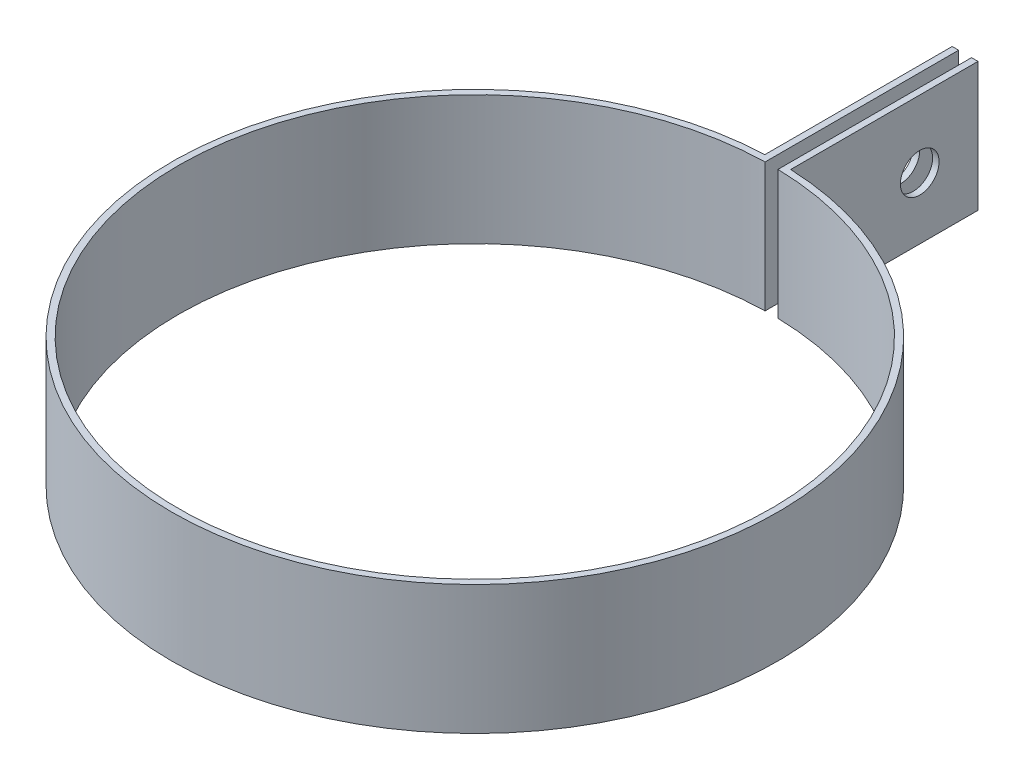
ISO-10303-21;
HEADER;
FILE_DESCRIPTION(('STEP AP214'),'2;1');
FILE_NAME('part.step','',(''),(''),'','','');
FILE_SCHEMA(('AUTOMOTIVE_DESIGN { 1 0 10303 214 1 1 1 1 }'));
ENDSEC;
DATA;
#1=APPLICATION_CONTEXT('core data for automotive mechanical design processes');
#2=APPLICATION_PROTOCOL_DEFINITION('international standard','automotive_design',2000,#1);
#3=PRODUCT_CONTEXT('',#1,'mechanical');
#4=PRODUCT('Part','Part','',(#3));
#5=PRODUCT_RELATED_PRODUCT_CATEGORY('part','',(#4));
#6=PRODUCT_DEFINITION_FORMATION('','',#4);
#7=PRODUCT_DEFINITION_CONTEXT('part definition',#1,'design');
#8=PRODUCT_DEFINITION('design','',#6,#7);
#9=PRODUCT_DEFINITION_SHAPE('','',#8);
#10=(LENGTH_UNIT() NAMED_UNIT(*) SI_UNIT(.MILLI.,.METRE.));
#11=(NAMED_UNIT(*) PLANE_ANGLE_UNIT() SI_UNIT($,.RADIAN.));
#12=(NAMED_UNIT(*) SI_UNIT($,.STERADIAN.) SOLID_ANGLE_UNIT());
#13=UNCERTAINTY_MEASURE_WITH_UNIT(LENGTH_MEASURE(1.E-05),#10,'distance_accuracy_value','');
#14=(GEOMETRIC_REPRESENTATION_CONTEXT(3) GLOBAL_UNCERTAINTY_ASSIGNED_CONTEXT((#13)) GLOBAL_UNIT_ASSIGNED_CONTEXT((#10,
#11,#12)) REPRESENTATION_CONTEXT('',''));
#15=CARTESIAN_POINT('',(0.,0.,0.));
#16=DIRECTION('',(0.,0.,1.));
#17=DIRECTION('',(1.,0.,0.));
#18=AXIS2_PLACEMENT_3D('',#15,#16,#17);
#19=CARTESIAN_POINT('',(-1.,10.,-37.9945645751338));
#20=DIRECTION('',(0.,0.,1.));
#21=DIRECTION('',(1.,0.,0.));
#22=AXIS2_PLACEMENT_3D('',#19,#20,#21);
#23=PLANE('',#22);
#24=DIRECTION('',(-1.,0.,0.));
#25=VECTOR('',#24,1.);
#26=CARTESIAN_POINT('',(-1.,0.,-37.9945645751338));
#27=LINE('',#26,#25);
#28=CARTESIAN_POINT('',(-0.500000000000005,0.,-37.9945645751338));
#29=VERTEX_POINT('',#28);
#30=CARTESIAN_POINT('',(-1.,0.,-37.9945645751338));
#31=VERTEX_POINT('',#30);
#32=EDGE_CURVE('E129',#29,#31,#27,.T.);
#33=ORIENTED_EDGE('',*,*,#32,.T.);
#34=DIRECTION('',(0.,-1.,0.));
#35=VECTOR('',#34,1.);
#36=CARTESIAN_POINT('',(-1.,10.,-37.9945645751338));
#37=LINE('',#36,#35);
#38=CARTESIAN_POINT('',(-1.,10.,-37.9945645751338));
#39=VERTEX_POINT('',#38);
#40=EDGE_CURVE('E11',#39,#31,#37,.T.);
#41=ORIENTED_EDGE('',*,*,#40,.F.);
#42=DIRECTION('',(-1.,0.,0.));
#43=VECTOR('',#42,1.);
#44=CARTESIAN_POINT('',(-1.,10.,-37.9945645751338));
#45=LINE('',#44,#43);
#46=CARTESIAN_POINT('',(-0.500000000000005,10.,-37.9945645751338));
#47=VERTEX_POINT('',#46);
#48=EDGE_CURVE('E144',#47,#39,#45,.T.);
#49=ORIENTED_EDGE('',*,*,#48,.F.);
#50=DIRECTION('',(0.,-1.,0.));
#51=VECTOR('',#50,1.);
#52=CARTESIAN_POINT('',(-0.500000000000005,10.,-37.9945645751338));
#53=LINE('',#52,#51);
#54=EDGE_CURVE('E125',#47,#29,#53,.T.);
#55=ORIENTED_EDGE('',*,*,#54,.T.);
#56=EDGE_LOOP('',(#33,#41,#49,#55));
#57=FACE_BOUND('',#56,.T.);
#58=ADVANCED_FACE('F32',(#57),#23,.F.);
#59=CARTESIAN_POINT('',(-1.,10.,-37.9945645751338));
#60=DIRECTION('',(1.,0.,0.));
#61=DIRECTION('',(0.,0.,-1.));
#62=AXIS2_PLACEMENT_3D('',#59,#60,#61);
#63=PLANE('',#62);
#64=CARTESIAN_POINT('',(-1.,4.78297531654448,-33.4787137637478));
#65=DIRECTION('',(1.,0.,0.));
#66=DIRECTION('',(0.,0.,-1.));
#67=AXIS2_PLACEMENT_3D('',#64,#65,#66);
#68=CIRCLE('',#67,1.5);
#69=CARTESIAN_POINT('',(-1.,4.78297531654448,-34.9787137637478));
#70=VERTEX_POINT('',#69);
#71=EDGE_CURVE('E133',#70,#70,#68,.T.);
#72=ORIENTED_EDGE('',*,*,#71,.T.);
#73=EDGE_LOOP('',(#72));
#74=FACE_BOUND('',#73,.T.);
#75=DIRECTION('',(0.,0.,1.));
#76=VECTOR('',#75,1.);
#77=CARTESIAN_POINT('',(-1.,0.,-37.9945645751338));
#78=LINE('',#77,#76);
#79=CARTESIAN_POINT('',(-1.,0.,-23.4787137637478));
#80=VERTEX_POINT('',#79);
#81=EDGE_CURVE('E132',#31,#80,#78,.T.);
#82=ORIENTED_EDGE('',*,*,#81,.T.);
#83=DIRECTION('',(0.,-1.,0.));
#84=VECTOR('',#83,1.);
#85=CARTESIAN_POINT('',(-1.,10.,-23.4787137637478));
#86=LINE('',#85,#84);
#87=CARTESIAN_POINT('',(-1.,10.,-23.4787137637478));
#88=VERTEX_POINT('',#87);
#89=EDGE_CURVE('E41',#88,#80,#86,.T.);
#90=ORIENTED_EDGE('',*,*,#89,.F.);
#91=DIRECTION('',(0.,0.,1.));
#92=VECTOR('',#91,1.);
#93=CARTESIAN_POINT('',(-1.,10.,-37.9945645751338));
#94=LINE('',#93,#92);
#95=EDGE_CURVE('E92',#39,#88,#94,.T.);
#96=ORIENTED_EDGE('',*,*,#95,.F.);
#97=ORIENTED_EDGE('',*,*,#40,.T.);
#98=EDGE_LOOP('',(#82,#90,#96,#97));
#99=FACE_BOUND('',#98,.T.);
#100=ADVANCED_FACE('F199',(#74,#99),#63,.F.);
#101=CARTESIAN_POINT('',(0.,10.,0.));
#102=DIRECTION('',(0.,-1.,0.));
#103=DIRECTION('',(0.,0.,-1.));
#104=AXIS2_PLACEMENT_3D('',#101,#102,#103);
#105=CYLINDRICAL_SURFACE('',#104,23.5);
#106=CARTESIAN_POINT('',(0.,0.,0.));
#107=DIRECTION('',(0.,1.,0.));
#108=DIRECTION('',(0.,0.,1.));
#109=AXIS2_PLACEMENT_3D('',#106,#107,#108);
#110=CIRCLE('',#109,23.5);
#111=CARTESIAN_POINT('',(0.999999999999997,0.,-23.4787137637478));
#112=VERTEX_POINT('',#111);
#113=EDGE_CURVE('E135',#80,#112,#110,.T.);
#114=ORIENTED_EDGE('',*,*,#113,.T.);
#115=DIRECTION('',(0.,-1.,0.));
#116=VECTOR('',#115,1.);
#117=CARTESIAN_POINT('',(0.999999999999997,10.,-23.4787137637478));
#118=LINE('',#117,#116);
#119=CARTESIAN_POINT('',(0.999999999999997,10.,-23.4787137637478));
#120=VERTEX_POINT('',#119);
#121=EDGE_CURVE('E151',#120,#112,#118,.T.);
#122=ORIENTED_EDGE('',*,*,#121,.F.);
#123=CARTESIAN_POINT('',(0.,10.,0.));
#124=DIRECTION('',(0.,1.,0.));
#125=DIRECTION('',(0.,0.,1.));
#126=AXIS2_PLACEMENT_3D('',#123,#124,#125);
#127=CIRCLE('',#126,23.5);
#128=EDGE_CURVE('E160',#88,#120,#127,.T.);
#129=ORIENTED_EDGE('',*,*,#128,.F.);
#130=ORIENTED_EDGE('',*,*,#89,.T.);
#131=EDGE_LOOP('',(#114,#122,#129,#130));
#132=FACE_BOUND('',#131,.T.);
#133=ADVANCED_FACE('F158',(#132),#105,.T.);
#134=CARTESIAN_POINT('',(0.999999999999995,10.,-37.9945645751338));
#135=DIRECTION('',(-1.,0.,0.));
#136=DIRECTION('',(0.,0.,1.));
#137=AXIS2_PLACEMENT_3D('',#134,#135,#136);
#138=PLANE('',#137);
#139=CARTESIAN_POINT('',(1.,4.78297531654448,-33.4787137637478));
#140=DIRECTION('',(1.,0.,0.));
#141=DIRECTION('',(0.,0.,-1.));
#142=AXIS2_PLACEMENT_3D('',#139,#140,#141);
#143=CIRCLE('',#142,1.5);
#144=CARTESIAN_POINT('',(1.,4.78297531654448,-34.9787137637478));
#145=VERTEX_POINT('',#144);
#146=EDGE_CURVE('E183',#145,#145,#143,.T.);
#147=ORIENTED_EDGE('',*,*,#146,.F.);
#148=EDGE_LOOP('',(#147));
#149=FACE_BOUND('',#148,.T.);
#150=DIRECTION('',(0.,0.,-1.));
#151=VECTOR('',#150,1.);
#152=CARTESIAN_POINT('',(0.999999999999995,0.,-37.9945645751338));
#153=LINE('',#152,#151);
#154=CARTESIAN_POINT('',(0.999999999999995,0.,-37.9945645751338));
#155=VERTEX_POINT('',#154);
#156=EDGE_CURVE('E137',#112,#155,#153,.T.);
#157=ORIENTED_EDGE('',*,*,#156,.T.);
#158=DIRECTION('',(0.,-1.,0.));
#159=VECTOR('',#158,1.);
#160=CARTESIAN_POINT('',(0.999999999999995,10.,-37.9945645751338));
#161=LINE('',#160,#159);
#162=CARTESIAN_POINT('',(0.999999999999995,10.,-37.9945645751338));
#163=VERTEX_POINT('',#162);
#164=EDGE_CURVE('E148',#163,#155,#161,.T.);
#165=ORIENTED_EDGE('',*,*,#164,.F.);
#166=DIRECTION('',(0.,0.,-1.));
#167=VECTOR('',#166,1.);
#168=CARTESIAN_POINT('',(0.999999999999995,10.,-37.9945645751338));
#169=LINE('',#168,#167);
#170=EDGE_CURVE('E172',#120,#163,#169,.T.);
#171=ORIENTED_EDGE('',*,*,#170,.F.);
#172=ORIENTED_EDGE('',*,*,#121,.T.);
#173=EDGE_LOOP('',(#157,#165,#171,#172));
#174=FACE_BOUND('',#173,.T.);
#175=ADVANCED_FACE('F168',(#149,#174),#138,.F.);
#176=CARTESIAN_POINT('',(0.499999999999995,10.,-37.9945645751338));
#177=DIRECTION('',(0.,0.,1.));
#178=DIRECTION('',(1.,0.,0.));
#179=AXIS2_PLACEMENT_3D('',#176,#177,#178);
#180=PLANE('',#179);
#181=DIRECTION('',(-1.,0.,0.));
#182=VECTOR('',#181,1.);
#183=CARTESIAN_POINT('',(0.499999999999995,0.,-37.9945645751338));
#184=LINE('',#183,#182);
#185=CARTESIAN_POINT('',(0.499999999999995,0.,-37.9945645751338));
#186=VERTEX_POINT('',#185);
#187=EDGE_CURVE('E139',#155,#186,#184,.T.);
#188=ORIENTED_EDGE('',*,*,#187,.T.);
#189=DIRECTION('',(0.,-1.,0.));
#190=VECTOR('',#189,1.);
#191=CARTESIAN_POINT('',(0.499999999999995,10.,-37.9945645751338));
#192=LINE('',#191,#190);
#193=CARTESIAN_POINT('',(0.499999999999995,10.,-37.9945645751338));
#194=VERTEX_POINT('',#193);
#195=EDGE_CURVE('E120',#194,#186,#192,.T.);
#196=ORIENTED_EDGE('',*,*,#195,.F.);
#197=DIRECTION('',(-1.,0.,0.));
#198=VECTOR('',#197,1.);
#199=CARTESIAN_POINT('',(0.499999999999995,10.,-37.9945645751338));
#200=LINE('',#199,#198);
#201=EDGE_CURVE('E111',#163,#194,#200,.T.);
#202=ORIENTED_EDGE('',*,*,#201,.F.);
#203=ORIENTED_EDGE('',*,*,#164,.T.);
#204=EDGE_LOOP('',(#188,#196,#202,#203));
#205=FACE_BOUND('',#204,.T.);
#206=ADVANCED_FACE('F171',(#205),#180,.F.);
#207=CARTESIAN_POINT('',(0.499999999999995,10.,-37.9945645751338));
#208=DIRECTION('',(1.,0.,0.));
#209=DIRECTION('',(0.,0.,-1.));
#210=AXIS2_PLACEMENT_3D('',#207,#208,#209);
#211=PLANE('',#210);
#212=CARTESIAN_POINT('',(0.499999999999997,4.78297531654448,-33.4787137637478));
#213=DIRECTION('',(1.,0.,0.));
#214=DIRECTION('',(0.,0.,-1.));
#215=AXIS2_PLACEMENT_3D('',#212,#213,#214);
#216=CIRCLE('',#215,1.5);
#217=CARTESIAN_POINT('',(0.499999999999997,4.78297531654448,-34.9787137637478));
#218=VERTEX_POINT('',#217);
#219=EDGE_CURVE('E180',#218,#218,#216,.T.);
#220=ORIENTED_EDGE('',*,*,#219,.T.);
#221=EDGE_LOOP('',(#220));
#222=FACE_BOUND('',#221,.T.);
#223=DIRECTION('',(0.,0.,1.));
#224=VECTOR('',#223,1.);
#225=CARTESIAN_POINT('',(0.499999999999995,0.,-37.9945645751338));
#226=LINE('',#225,#224);
#227=CARTESIAN_POINT('',(0.499999999999997,0.,-22.9945645751338));
#228=VERTEX_POINT('',#227);
#229=EDGE_CURVE('E119',#186,#228,#226,.T.);
#230=ORIENTED_EDGE('',*,*,#229,.T.);
#231=DIRECTION('',(0.,-1.,0.));
#232=VECTOR('',#231,1.);
#233=CARTESIAN_POINT('',(0.499999999999997,10.,-22.9945645751338));
#234=LINE('',#233,#232);
#235=CARTESIAN_POINT('',(0.499999999999997,10.,-22.9945645751338));
#236=VERTEX_POINT('',#235);
#237=EDGE_CURVE('E116',#236,#228,#234,.T.);
#238=ORIENTED_EDGE('',*,*,#237,.F.);
#239=DIRECTION('',(0.,0.,1.));
#240=VECTOR('',#239,1.);
#241=CARTESIAN_POINT('',(0.499999999999995,10.,-37.9945645751338));
#242=LINE('',#241,#240);
#243=EDGE_CURVE('E105',#194,#236,#242,.T.);
#244=ORIENTED_EDGE('',*,*,#243,.F.);
#245=ORIENTED_EDGE('',*,*,#195,.T.);
#246=EDGE_LOOP('',(#230,#238,#244,#245));
#247=FACE_BOUND('',#246,.T.);
#248=ADVANCED_FACE('F117',(#222,#247),#211,.F.);
#249=CARTESIAN_POINT('',(0.,10.,0.));
#250=DIRECTION('',(0.,-1.,0.));
#251=DIRECTION('',(0.,0.,-1.));
#252=AXIS2_PLACEMENT_3D('',#249,#250,#251);
#253=CYLINDRICAL_SURFACE('',#252,23.);
#254=CARTESIAN_POINT('',(0.,0.,0.));
#255=DIRECTION('',(0.,-1.,0.));
#256=DIRECTION('',(0.,0.,1.));
#257=AXIS2_PLACEMENT_3D('',#254,#255,#256);
#258=CIRCLE('',#257,23.);
#259=CARTESIAN_POINT('',(-0.500000000000001,0.,-22.9945645751338));
#260=VERTEX_POINT('',#259);
#261=EDGE_CURVE('E78',#228,#260,#258,.T.);
#262=ORIENTED_EDGE('',*,*,#261,.T.);
#263=DIRECTION('',(0.,-1.,0.));
#264=VECTOR('',#263,1.);
#265=CARTESIAN_POINT('',(-0.500000000000001,10.,-22.9945645751338));
#266=LINE('',#265,#264);
#267=CARTESIAN_POINT('',(-0.500000000000001,10.,-22.9945645751338));
#268=VERTEX_POINT('',#267);
#269=EDGE_CURVE('E121',#268,#260,#266,.T.);
#270=ORIENTED_EDGE('',*,*,#269,.F.);
#271=CARTESIAN_POINT('',(0.,10.,0.));
#272=DIRECTION('',(0.,-1.,0.));
#273=DIRECTION('',(0.,0.,1.));
#274=AXIS2_PLACEMENT_3D('',#271,#272,#273);
#275=CIRCLE('',#274,23.);
#276=EDGE_CURVE('E109',#236,#268,#275,.T.);
#277=ORIENTED_EDGE('',*,*,#276,.F.);
#278=ORIENTED_EDGE('',*,*,#237,.T.);
#279=EDGE_LOOP('',(#262,#270,#277,#278));
#280=FACE_BOUND('',#279,.T.);
#281=ADVANCED_FACE('F123',(#280),#253,.F.);
#282=CARTESIAN_POINT('',(-0.500000000000005,10.,-37.9945645751338));
#283=DIRECTION('',(-1.,0.,0.));
#284=DIRECTION('',(0.,0.,1.));
#285=AXIS2_PLACEMENT_3D('',#282,#283,#284);
#286=PLANE('',#285);
#287=CARTESIAN_POINT('',(-0.500000000000004,4.78297531654448,-33.4787137637478));
#288=DIRECTION('',(-1.,0.,0.));
#289=DIRECTION('',(0.,0.,1.));
#290=AXIS2_PLACEMENT_3D('',#287,#288,#289);
#291=CIRCLE('',#290,1.5);
#292=CARTESIAN_POINT('',(-0.500000000000004,4.78297531654448,-31.9787137637478));
#293=VERTEX_POINT('',#292);
#294=EDGE_CURVE('E35',#293,#293,#291,.T.);
#295=ORIENTED_EDGE('',*,*,#294,.T.);
#296=EDGE_LOOP('',(#295));
#297=FACE_BOUND('',#296,.T.);
#298=DIRECTION('',(0.,0.,-1.));
#299=VECTOR('',#298,1.);
#300=CARTESIAN_POINT('',(-0.500000000000005,0.,-37.9945645751338));
#301=LINE('',#300,#299);
#302=EDGE_CURVE('E84',#260,#29,#301,.T.);
#303=ORIENTED_EDGE('',*,*,#302,.T.);
#304=ORIENTED_EDGE('',*,*,#54,.F.);
#305=DIRECTION('',(0.,0.,-1.));
#306=VECTOR('',#305,1.);
#307=CARTESIAN_POINT('',(-0.500000000000005,10.,-37.9945645751338));
#308=LINE('',#307,#306);
#309=EDGE_CURVE('E49',#268,#47,#308,.T.);
#310=ORIENTED_EDGE('',*,*,#309,.F.);
#311=ORIENTED_EDGE('',*,*,#269,.T.);
#312=EDGE_LOOP('',(#303,#304,#310,#311));
#313=FACE_BOUND('',#312,.T.);
#314=ADVANCED_FACE('F190',(#297,#313),#286,.F.);
#315=CARTESIAN_POINT('',(0.,10.,0.));
#316=DIRECTION('',(0.,1.,0.));
#317=DIRECTION('',(0.,0.,1.));
#318=AXIS2_PLACEMENT_3D('',#315,#316,#317);
#319=PLANE('',#318);
#320=ORIENTED_EDGE('',*,*,#48,.T.);
#321=ORIENTED_EDGE('',*,*,#95,.T.);
#322=ORIENTED_EDGE('',*,*,#128,.T.);
#323=ORIENTED_EDGE('',*,*,#170,.T.);
#324=ORIENTED_EDGE('',*,*,#201,.T.);
#325=ORIENTED_EDGE('',*,*,#243,.T.);
#326=ORIENTED_EDGE('',*,*,#276,.T.);
#327=ORIENTED_EDGE('',*,*,#309,.T.);
#328=EDGE_LOOP('',(#320,#321,#322,#323,#324,#325,#326,#327));
#329=FACE_BOUND('',#328,.T.);
#330=ADVANCED_FACE('F107',(#329),#319,.T.);
#331=CARTESIAN_POINT('',(0.,0.,0.));
#332=DIRECTION('',(0.,1.,0.));
#333=DIRECTION('',(0.,0.,1.));
#334=AXIS2_PLACEMENT_3D('',#331,#332,#333);
#335=PLANE('',#334);
#336=ORIENTED_EDGE('',*,*,#32,.F.);
#337=ORIENTED_EDGE('',*,*,#302,.F.);
#338=ORIENTED_EDGE('',*,*,#261,.F.);
#339=ORIENTED_EDGE('',*,*,#229,.F.);
#340=ORIENTED_EDGE('',*,*,#187,.F.);
#341=ORIENTED_EDGE('',*,*,#156,.F.);
#342=ORIENTED_EDGE('',*,*,#113,.F.);
#343=ORIENTED_EDGE('',*,*,#81,.F.);
#344=EDGE_LOOP('',(#336,#337,#338,#339,#340,#341,#342,#343));
#345=FACE_BOUND('',#344,.T.);
#346=ADVANCED_FACE('F164',(#345),#335,.F.);
#347=CARTESIAN_POINT('',(-23.5,4.78297531654448,-33.4787137637478));
#348=DIRECTION('',(1.,0.,0.));
#349=DIRECTION('',(0.,0.,-1.));
#350=AXIS2_PLACEMENT_3D('',#347,#348,#349);
#351=CYLINDRICAL_SURFACE('',#350,1.5);
#352=ORIENTED_EDGE('',*,*,#294,.F.);
#353=EDGE_LOOP('',(#352));
#354=FACE_BOUND('',#353,.T.);
#355=ORIENTED_EDGE('',*,*,#71,.F.);
#356=EDGE_LOOP('',(#355));
#357=FACE_BOUND('',#356,.T.);
#358=ADVANCED_FACE('F192',(#354,#357),#351,.F.);
#359=ORIENTED_EDGE('',*,*,#146,.T.);
#360=EDGE_LOOP('',(#359));
#361=FACE_BOUND('',#360,.T.);
#362=ORIENTED_EDGE('',*,*,#219,.F.);
#363=EDGE_LOOP('',(#362));
#364=FACE_BOUND('',#363,.T.);
#365=ADVANCED_FACE('F195',(#361,#364),#351,.F.);
#366=CLOSED_SHELL('',(#58,#100,#133,#175,#206,#248,#281,#314,#330,#346,#358,#365));
#367=MANIFOLD_SOLID_BREP('B2',#366);
#368=ADVANCED_BREP_SHAPE_REPRESENTATION('',(#18,#367),#14);
#369=SHAPE_DEFINITION_REPRESENTATION(#9,#368);
ENDSEC;
END-ISO-10303-21;
